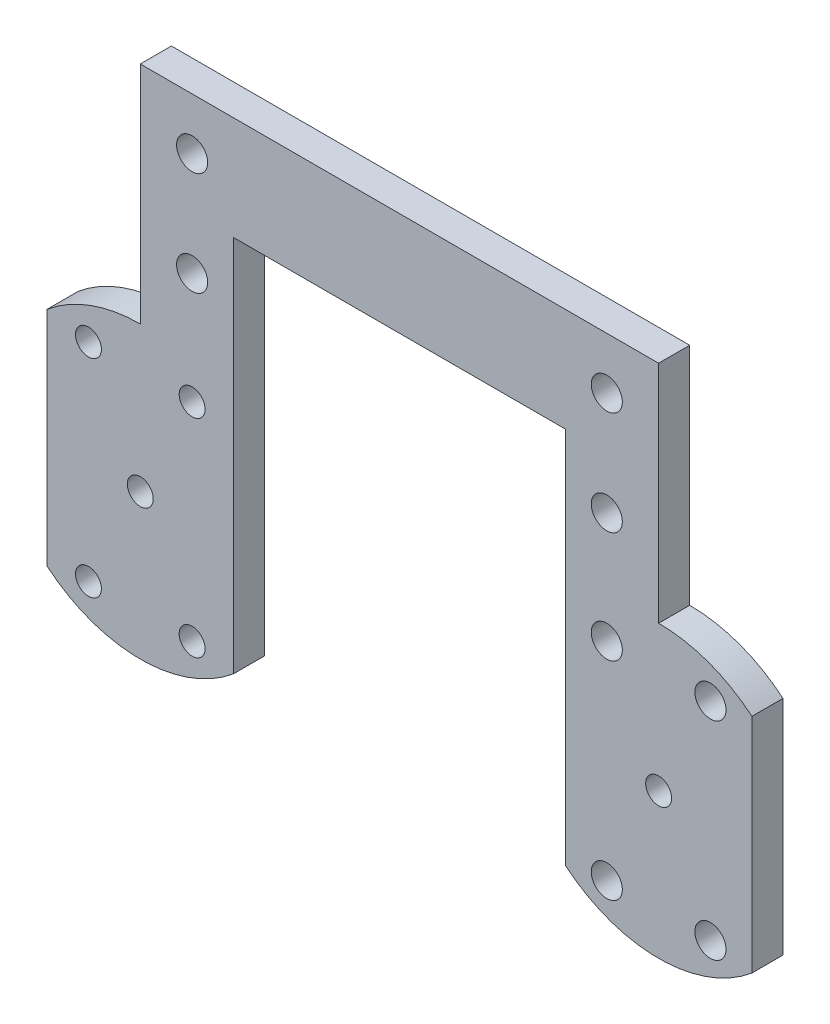
ISO-10303-21;
HEADER;
FILE_DESCRIPTION(('STEP AP214'),'2;1');
FILE_NAME('part.step','',(''),(''),'','','');
FILE_SCHEMA(('AUTOMOTIVE_DESIGN { 1 0 10303 214 1 1 1 1 }'));
ENDSEC;
DATA;
#1=APPLICATION_CONTEXT('core data for automotive mechanical design processes');
#2=APPLICATION_PROTOCOL_DEFINITION('international standard','automotive_design',2000,#1);
#3=PRODUCT_CONTEXT('',#1,'mechanical');
#4=PRODUCT('Part','Part','',(#3));
#5=PRODUCT_RELATED_PRODUCT_CATEGORY('part','',(#4));
#6=PRODUCT_DEFINITION_FORMATION('','',#4);
#7=PRODUCT_DEFINITION_CONTEXT('part definition',#1,'design');
#8=PRODUCT_DEFINITION('design','',#6,#7);
#9=PRODUCT_DEFINITION_SHAPE('','',#8);
#10=(LENGTH_UNIT() NAMED_UNIT(*) SI_UNIT(.MILLI.,.METRE.));
#11=(NAMED_UNIT(*) PLANE_ANGLE_UNIT() SI_UNIT($,.RADIAN.));
#12=(NAMED_UNIT(*) SI_UNIT($,.STERADIAN.) SOLID_ANGLE_UNIT());
#13=UNCERTAINTY_MEASURE_WITH_UNIT(LENGTH_MEASURE(1.E-05),#10,'distance_accuracy_value','');
#14=(GEOMETRIC_REPRESENTATION_CONTEXT(3) GLOBAL_UNCERTAINTY_ASSIGNED_CONTEXT((#13)) GLOBAL_UNIT_ASSIGNED_CONTEXT((#10,
#11,#12)) REPRESENTATION_CONTEXT('',''));
#15=CARTESIAN_POINT('',(0.,0.,0.));
#16=DIRECTION('',(0.,0.,1.));
#17=DIRECTION('',(1.,0.,0.));
#18=AXIS2_PLACEMENT_3D('',#15,#16,#17);
#19=CARTESIAN_POINT('',(0.,0.,3.));
#20=DIRECTION('',(0.,0.,1.));
#21=DIRECTION('',(1.,0.,0.));
#22=AXIS2_PLACEMENT_3D('',#19,#20,#21);
#23=PLANE('',#22);
#24=CARTESIAN_POINT('',(0.,0.,3.));
#25=DIRECTION('',(0.,0.,1.));
#26=DIRECTION('',(1.,0.,0.));
#27=AXIS2_PLACEMENT_3D('',#24,#25,#26);
#28=CIRCLE('',#27,14.);
#29=CARTESIAN_POINT('',(-9.,-10.7238052947636,3.));
#30=VERTEX_POINT('',#29);
#31=CARTESIAN_POINT('',(9.,-10.7238052947636,3.));
#32=VERTEX_POINT('',#31);
#33=EDGE_CURVE('E212',#30,#32,#28,.T.);
#34=ORIENTED_EDGE('',*,*,#33,.T.);
#35=DIRECTION('',(0.,1.,0.));
#36=VECTOR('',#35,1.);
#37=CARTESIAN_POINT('',(9.,10.7238052947636,3.));
#38=LINE('',#37,#36);
#39=CARTESIAN_POINT('',(9.,25.7238052947636,3.));
#40=VERTEX_POINT('',#39);
#41=EDGE_CURVE('E137',#32,#40,#38,.T.);
#42=ORIENTED_EDGE('',*,*,#41,.T.);
#43=DIRECTION('',(1.,0.,0.));
#44=VECTOR('',#43,1.);
#45=CARTESIAN_POINT('',(9.,25.7238052947636,3.));
#46=LINE('',#45,#44);
#47=CARTESIAN_POINT('',(41.,25.7238052947636,3.));
#48=VERTEX_POINT('',#47);
#49=EDGE_CURVE('E217',#40,#48,#46,.T.);
#50=ORIENTED_EDGE('',*,*,#49,.T.);
#51=DIRECTION('',(0.,-1.,0.));
#52=VECTOR('',#51,1.);
#53=CARTESIAN_POINT('',(41.,25.7238052947636,3.));
#54=LINE('',#53,#52);
#55=CARTESIAN_POINT('',(41.,-10.7238052947636,3.));
#56=VERTEX_POINT('',#55);
#57=EDGE_CURVE('E215',#48,#56,#54,.T.);
#58=ORIENTED_EDGE('',*,*,#57,.T.);
#59=CARTESIAN_POINT('',(50.,0.,3.));
#60=DIRECTION('',(0.,0.,1.));
#61=DIRECTION('',(1.,0.,0.));
#62=AXIS2_PLACEMENT_3D('',#59,#60,#61);
#63=CIRCLE('',#62,14.);
#64=CARTESIAN_POINT('',(59.,-10.7238052947636,3.));
#65=VERTEX_POINT('',#64);
#66=EDGE_CURVE('E173',#56,#65,#63,.T.);
#67=ORIENTED_EDGE('',*,*,#66,.T.);
#68=DIRECTION('',(0.,1.,0.));
#69=VECTOR('',#68,1.);
#70=CARTESIAN_POINT('',(59.,10.7238052947636,3.));
#71=LINE('',#70,#69);
#72=CARTESIAN_POINT('',(59.,10.7238052947636,3.));
#73=VERTEX_POINT('',#72);
#74=EDGE_CURVE('E192',#65,#73,#71,.T.);
#75=ORIENTED_EDGE('',*,*,#74,.T.);
#76=CARTESIAN_POINT('',(50.,0.,3.));
#77=DIRECTION('',(0.,0.,1.));
#78=DIRECTION('',(1.,0.,0.));
#79=AXIS2_PLACEMENT_3D('',#76,#77,#78);
#80=CIRCLE('',#79,14.);
#81=CARTESIAN_POINT('',(50.,14.,3.));
#82=VERTEX_POINT('',#81);
#83=EDGE_CURVE('E163',#73,#82,#80,.T.);
#84=ORIENTED_EDGE('',*,*,#83,.T.);
#85=DIRECTION('',(0.,1.,0.));
#86=VECTOR('',#85,1.);
#87=CARTESIAN_POINT('',(50.,35.7238052947636,3.));
#88=LINE('',#87,#86);
#89=CARTESIAN_POINT('',(50.,35.7238052947636,3.));
#90=VERTEX_POINT('',#89);
#91=EDGE_CURVE('E219',#82,#90,#88,.T.);
#92=ORIENTED_EDGE('',*,*,#91,.T.);
#93=DIRECTION('',(-1.,0.,0.));
#94=VECTOR('',#93,1.);
#95=CARTESIAN_POINT('',(0.,35.7238052947636,3.));
#96=LINE('',#95,#94);
#97=CARTESIAN_POINT('',(0.,35.7238052947636,3.));
#98=VERTEX_POINT('',#97);
#99=EDGE_CURVE('E360',#90,#98,#96,.T.);
#100=ORIENTED_EDGE('',*,*,#99,.T.);
#101=DIRECTION('',(0.,-1.,0.));
#102=VECTOR('',#101,1.);
#103=CARTESIAN_POINT('',(0.,14.,3.));
#104=LINE('',#103,#102);
#105=CARTESIAN_POINT('',(0.,14.,3.));
#106=VERTEX_POINT('',#105);
#107=EDGE_CURVE('E363',#98,#106,#104,.T.);
#108=ORIENTED_EDGE('',*,*,#107,.T.);
#109=CARTESIAN_POINT('',(0.,0.,3.));
#110=DIRECTION('',(0.,0.,1.));
#111=DIRECTION('',(1.,0.,0.));
#112=AXIS2_PLACEMENT_3D('',#109,#110,#111);
#113=CIRCLE('',#112,14.);
#114=CARTESIAN_POINT('',(-9.,10.7238052947636,3.));
#115=VERTEX_POINT('',#114);
#116=EDGE_CURVE('E48',#106,#115,#113,.T.);
#117=ORIENTED_EDGE('',*,*,#116,.T.);
#118=DIRECTION('',(0.,-1.,0.));
#119=VECTOR('',#118,1.);
#120=CARTESIAN_POINT('',(-9.,10.7238052947636,3.));
#121=LINE('',#120,#119);
#122=EDGE_CURVE('E210',#115,#30,#121,.T.);
#123=ORIENTED_EDGE('',*,*,#122,.T.);
#124=EDGE_LOOP('',(#34,#42,#50,#58,#67,#75,#84,#92,#100,#108,#117,#123));
#125=FACE_BOUND('',#124,.T.);
#126=CARTESIAN_POINT('',(55.,-10.,3.));
#127=DIRECTION('',(0.,0.,1.));
#128=DIRECTION('',(1.,0.,0.));
#129=AXIS2_PLACEMENT_3D('',#126,#127,#128);
#130=CIRCLE('',#129,1.5);
#131=CARTESIAN_POINT('',(56.5,-10.,3.));
#132=VERTEX_POINT('',#131);
#133=EDGE_CURVE('E239',#132,#132,#130,.T.);
#134=ORIENTED_EDGE('',*,*,#133,.F.);
#135=EDGE_LOOP('',(#134));
#136=FACE_BOUND('',#135,.T.);
#137=CARTESIAN_POINT('',(55.,10.,3.));
#138=DIRECTION('',(0.,0.,1.));
#139=DIRECTION('',(1.,0.,0.));
#140=AXIS2_PLACEMENT_3D('',#137,#138,#139);
#141=CIRCLE('',#140,1.5);
#142=CARTESIAN_POINT('',(56.5,10.,3.));
#143=VERTEX_POINT('',#142);
#144=EDGE_CURVE('E253',#143,#143,#141,.T.);
#145=ORIENTED_EDGE('',*,*,#144,.F.);
#146=EDGE_LOOP('',(#145));
#147=FACE_BOUND('',#146,.T.);
#148=CARTESIAN_POINT('',(50.,0.,3.));
#149=DIRECTION('',(0.,0.,1.));
#150=DIRECTION('',(1.,0.,0.));
#151=AXIS2_PLACEMENT_3D('',#148,#149,#150);
#152=CIRCLE('',#151,1.25);
#153=CARTESIAN_POINT('',(51.25,0.,3.));
#154=VERTEX_POINT('',#153);
#155=EDGE_CURVE('E265',#154,#154,#152,.T.);
#156=ORIENTED_EDGE('',*,*,#155,.F.);
#157=EDGE_LOOP('',(#156));
#158=FACE_BOUND('',#157,.T.);
#159=CARTESIAN_POINT('',(-5.,-10.,3.));
#160=DIRECTION('',(0.,0.,1.));
#161=DIRECTION('',(1.,0.,0.));
#162=AXIS2_PLACEMENT_3D('',#159,#160,#161);
#163=CIRCLE('',#162,1.25);
#164=CARTESIAN_POINT('',(-3.75,-10.,3.));
#165=VERTEX_POINT('',#164);
#166=EDGE_CURVE('E277',#165,#165,#163,.T.);
#167=ORIENTED_EDGE('',*,*,#166,.F.);
#168=EDGE_LOOP('',(#167));
#169=FACE_BOUND('',#168,.T.);
#170=CARTESIAN_POINT('',(-5.,10.,3.));
#171=DIRECTION('',(0.,0.,1.));
#172=DIRECTION('',(1.,0.,0.));
#173=AXIS2_PLACEMENT_3D('',#170,#171,#172);
#174=CIRCLE('',#173,1.25);
#175=CARTESIAN_POINT('',(-3.75,10.,3.));
#176=VERTEX_POINT('',#175);
#177=EDGE_CURVE('E203',#176,#176,#174,.T.);
#178=ORIENTED_EDGE('',*,*,#177,.F.);
#179=EDGE_LOOP('',(#178));
#180=FACE_BOUND('',#179,.T.);
#181=CARTESIAN_POINT('',(0.,0.,3.));
#182=DIRECTION('',(0.,0.,1.));
#183=DIRECTION('',(1.,0.,0.));
#184=AXIS2_PLACEMENT_3D('',#181,#182,#183);
#185=CIRCLE('',#184,1.25);
#186=CARTESIAN_POINT('',(1.25,0.,3.));
#187=VERTEX_POINT('',#186);
#188=EDGE_CURVE('E196',#187,#187,#185,.T.);
#189=ORIENTED_EDGE('',*,*,#188,.F.);
#190=EDGE_LOOP('',(#189));
#191=FACE_BOUND('',#190,.T.);
#192=CARTESIAN_POINT('',(5.,10.,3.));
#193=DIRECTION('',(0.,0.,1.));
#194=DIRECTION('',(1.,0.,0.));
#195=AXIS2_PLACEMENT_3D('',#192,#193,#194);
#196=CIRCLE('',#195,1.25);
#197=CARTESIAN_POINT('',(6.25,10.,3.));
#198=VERTEX_POINT('',#197);
#199=EDGE_CURVE('E283',#198,#198,#196,.T.);
#200=ORIENTED_EDGE('',*,*,#199,.F.);
#201=EDGE_LOOP('',(#200));
#202=FACE_BOUND('',#201,.T.);
#203=CARTESIAN_POINT('',(5.,-10.,3.));
#204=DIRECTION('',(0.,0.,1.));
#205=DIRECTION('',(1.,0.,0.));
#206=AXIS2_PLACEMENT_3D('',#203,#204,#205);
#207=CIRCLE('',#206,1.25);
#208=CARTESIAN_POINT('',(6.25,-10.,3.));
#209=VERTEX_POINT('',#208);
#210=EDGE_CURVE('E271',#209,#209,#207,.T.);
#211=ORIENTED_EDGE('',*,*,#210,.F.);
#212=EDGE_LOOP('',(#211));
#213=FACE_BOUND('',#212,.T.);
#214=CARTESIAN_POINT('',(45.,10.,3.));
#215=DIRECTION('',(0.,0.,1.));
#216=DIRECTION('',(1.,0.,0.));
#217=AXIS2_PLACEMENT_3D('',#214,#215,#216);
#218=CIRCLE('',#217,1.5);
#219=CARTESIAN_POINT('',(46.5,10.,3.));
#220=VERTEX_POINT('',#219);
#221=EDGE_CURVE('E259',#220,#220,#218,.T.);
#222=ORIENTED_EDGE('',*,*,#221,.F.);
#223=EDGE_LOOP('',(#222));
#224=FACE_BOUND('',#223,.T.);
#225=CARTESIAN_POINT('',(45.,-10.,3.));
#226=DIRECTION('',(0.,0.,1.));
#227=DIRECTION('',(1.,0.,0.));
#228=AXIS2_PLACEMENT_3D('',#225,#226,#227);
#229=CIRCLE('',#228,1.5);
#230=CARTESIAN_POINT('',(46.5,-10.,3.));
#231=VERTEX_POINT('',#230);
#232=EDGE_CURVE('E247',#231,#231,#229,.T.);
#233=ORIENTED_EDGE('',*,*,#232,.F.);
#234=EDGE_LOOP('',(#233));
#235=FACE_BOUND('',#234,.T.);
#236=CARTESIAN_POINT('',(5.,20.7238052947636,3.));
#237=DIRECTION('',(0.,0.,1.));
#238=DIRECTION('',(1.,0.,0.));
#239=AXIS2_PLACEMENT_3D('',#236,#237,#238);
#240=CIRCLE('',#239,1.5);
#241=CARTESIAN_POINT('',(6.5,20.7238052947636,3.));
#242=VERTEX_POINT('',#241);
#243=EDGE_CURVE('E348',#242,#242,#240,.T.);
#244=ORIENTED_EDGE('',*,*,#243,.F.);
#245=EDGE_LOOP('',(#244));
#246=FACE_BOUND('',#245,.T.);
#247=CARTESIAN_POINT('',(45.,20.7238052947636,3.));
#248=DIRECTION('',(0.,0.,1.));
#249=DIRECTION('',(1.,0.,0.));
#250=AXIS2_PLACEMENT_3D('',#247,#248,#249);
#251=CIRCLE('',#250,1.5);
#252=CARTESIAN_POINT('',(46.5,20.7238052947636,3.));
#253=VERTEX_POINT('',#252);
#254=EDGE_CURVE('E351',#253,#253,#251,.T.);
#255=ORIENTED_EDGE('',*,*,#254,.F.);
#256=EDGE_LOOP('',(#255));
#257=FACE_BOUND('',#256,.T.);
#258=CARTESIAN_POINT('',(45.,30.7238052947636,3.));
#259=DIRECTION('',(0.,0.,1.));
#260=DIRECTION('',(1.,0.,0.));
#261=AXIS2_PLACEMENT_3D('',#258,#259,#260);
#262=CIRCLE('',#261,1.5);
#263=CARTESIAN_POINT('',(46.5,30.7238052947636,3.));
#264=VERTEX_POINT('',#263);
#265=EDGE_CURVE('E354',#264,#264,#262,.T.);
#266=ORIENTED_EDGE('',*,*,#265,.F.);
#267=EDGE_LOOP('',(#266));
#268=FACE_BOUND('',#267,.T.);
#269=CARTESIAN_POINT('',(5.,30.7238052947636,3.));
#270=DIRECTION('',(0.,0.,1.));
#271=DIRECTION('',(1.,0.,0.));
#272=AXIS2_PLACEMENT_3D('',#269,#270,#271);
#273=CIRCLE('',#272,1.5);
#274=CARTESIAN_POINT('',(6.5,30.7238052947636,3.));
#275=VERTEX_POINT('',#274);
#276=EDGE_CURVE('E357',#275,#275,#273,.T.);
#277=ORIENTED_EDGE('',*,*,#276,.F.);
#278=EDGE_LOOP('',(#277));
#279=FACE_BOUND('',#278,.T.);
#280=ADVANCED_FACE('F33',(#125,#136,#147,#158,#169,#180,#191,#202,#213,#224,#235,#246,#257,#268,
#279),#23,.T.);
#281=CARTESIAN_POINT('',(0.,0.,0.));
#282=DIRECTION('',(0.,0.,1.));
#283=DIRECTION('',(1.,0.,0.));
#284=AXIS2_PLACEMENT_3D('',#281,#282,#283);
#285=PLANE('',#284);
#286=DIRECTION('',(0.,-1.,0.));
#287=VECTOR('',#286,1.);
#288=CARTESIAN_POINT('',(9.,10.7238052947636,0.));
#289=LINE('',#288,#287);
#290=CARTESIAN_POINT('',(9.,25.7238052947636,0.));
#291=VERTEX_POINT('',#290);
#292=CARTESIAN_POINT('',(9.,-10.7238052947636,0.));
#293=VERTEX_POINT('',#292);
#294=EDGE_CURVE('E120',#291,#293,#289,.T.);
#295=ORIENTED_EDGE('',*,*,#294,.T.);
#296=CARTESIAN_POINT('',(0.,0.,0.));
#297=DIRECTION('',(0.,0.,1.));
#298=DIRECTION('',(1.,0.,0.));
#299=AXIS2_PLACEMENT_3D('',#296,#297,#298);
#300=CIRCLE('',#299,14.);
#301=CARTESIAN_POINT('',(-9.,-10.7238052947636,0.));
#302=VERTEX_POINT('',#301);
#303=EDGE_CURVE('E126',#302,#293,#300,.T.);
#304=ORIENTED_EDGE('',*,*,#303,.F.);
#305=DIRECTION('',(0.,-1.,0.));
#306=VECTOR('',#305,1.);
#307=CARTESIAN_POINT('',(-9.,10.7238052947636,0.));
#308=LINE('',#307,#306);
#309=CARTESIAN_POINT('',(-9.,10.7238052947636,0.));
#310=VERTEX_POINT('',#309);
#311=EDGE_CURVE('E147',#310,#302,#308,.T.);
#312=ORIENTED_EDGE('',*,*,#311,.F.);
#313=CARTESIAN_POINT('',(0.,0.,0.));
#314=DIRECTION('',(0.,0.,1.));
#315=DIRECTION('',(1.,0.,0.));
#316=AXIS2_PLACEMENT_3D('',#313,#314,#315);
#317=CIRCLE('',#316,14.);
#318=CARTESIAN_POINT('',(0.,14.,0.));
#319=VERTEX_POINT('',#318);
#320=EDGE_CURVE('E151',#319,#310,#317,.T.);
#321=ORIENTED_EDGE('',*,*,#320,.F.);
#322=DIRECTION('',(0.,1.,0.));
#323=VECTOR('',#322,1.);
#324=CARTESIAN_POINT('',(0.,14.,0.));
#325=LINE('',#324,#323);
#326=CARTESIAN_POINT('',(0.,35.7238052947636,0.));
#327=VERTEX_POINT('',#326);
#328=EDGE_CURVE('E330',#319,#327,#325,.T.);
#329=ORIENTED_EDGE('',*,*,#328,.T.);
#330=DIRECTION('',(1.,0.,0.));
#331=VECTOR('',#330,1.);
#332=CARTESIAN_POINT('',(0.,35.7238052947636,0.));
#333=LINE('',#332,#331);
#334=CARTESIAN_POINT('',(50.,35.7238052947636,0.));
#335=VERTEX_POINT('',#334);
#336=EDGE_CURVE('E337',#327,#335,#333,.T.);
#337=ORIENTED_EDGE('',*,*,#336,.T.);
#338=DIRECTION('',(0.,-1.,0.));
#339=VECTOR('',#338,1.);
#340=CARTESIAN_POINT('',(50.,35.7238052947636,0.));
#341=LINE('',#340,#339);
#342=CARTESIAN_POINT('',(50.,14.,0.));
#343=VERTEX_POINT('',#342);
#344=EDGE_CURVE('E341',#335,#343,#341,.T.);
#345=ORIENTED_EDGE('',*,*,#344,.T.);
#346=CARTESIAN_POINT('',(50.,0.,0.));
#347=DIRECTION('',(0.,0.,1.));
#348=DIRECTION('',(1.,0.,0.));
#349=AXIS2_PLACEMENT_3D('',#346,#347,#348);
#350=CIRCLE('',#349,14.);
#351=CARTESIAN_POINT('',(59.,10.7238052947636,0.));
#352=VERTEX_POINT('',#351);
#353=EDGE_CURVE('E156',#352,#343,#350,.T.);
#354=ORIENTED_EDGE('',*,*,#353,.F.);
#355=DIRECTION('',(0.,1.,0.));
#356=VECTOR('',#355,1.);
#357=CARTESIAN_POINT('',(59.,10.7238052947636,0.));
#358=LINE('',#357,#356);
#359=CARTESIAN_POINT('',(59.,-10.7238052947636,0.));
#360=VERTEX_POINT('',#359);
#361=EDGE_CURVE('E149',#360,#352,#358,.T.);
#362=ORIENTED_EDGE('',*,*,#361,.F.);
#363=CARTESIAN_POINT('',(50.,0.,0.));
#364=DIRECTION('',(0.,0.,1.));
#365=DIRECTION('',(1.,0.,0.));
#366=AXIS2_PLACEMENT_3D('',#363,#364,#365);
#367=CIRCLE('',#366,14.);
#368=CARTESIAN_POINT('',(41.,-10.7238052947636,0.));
#369=VERTEX_POINT('',#368);
#370=EDGE_CURVE('E146',#369,#360,#367,.T.);
#371=ORIENTED_EDGE('',*,*,#370,.F.);
#372=DIRECTION('',(0.,1.,0.));
#373=VECTOR('',#372,1.);
#374=CARTESIAN_POINT('',(41.,25.7238052947636,0.));
#375=LINE('',#374,#373);
#376=CARTESIAN_POINT('',(41.,25.7238052947636,0.));
#377=VERTEX_POINT('',#376);
#378=EDGE_CURVE('E177',#369,#377,#375,.T.);
#379=ORIENTED_EDGE('',*,*,#378,.T.);
#380=DIRECTION('',(-1.,0.,0.));
#381=VECTOR('',#380,1.);
#382=CARTESIAN_POINT('',(9.,25.7238052947636,0.));
#383=LINE('',#382,#381);
#384=EDGE_CURVE('E128',#377,#291,#383,.T.);
#385=ORIENTED_EDGE('',*,*,#384,.T.);
#386=EDGE_LOOP('',(#295,#304,#312,#321,#329,#337,#345,#354,#362,#371,#379,#385));
#387=FACE_BOUND('',#386,.T.);
#388=CARTESIAN_POINT('',(0.,0.,0.));
#389=DIRECTION('',(0.,0.,1.));
#390=DIRECTION('',(1.,0.,0.));
#391=AXIS2_PLACEMENT_3D('',#388,#389,#390);
#392=CIRCLE('',#391,1.25);
#393=CARTESIAN_POINT('',(1.25,0.,0.));
#394=VERTEX_POINT('',#393);
#395=EDGE_CURVE('E198',#394,#394,#392,.T.);
#396=ORIENTED_EDGE('',*,*,#395,.T.);
#397=EDGE_LOOP('',(#396));
#398=FACE_BOUND('',#397,.T.);
#399=CARTESIAN_POINT('',(-5.,10.,0.));
#400=DIRECTION('',(0.,0.,1.));
#401=DIRECTION('',(1.,0.,0.));
#402=AXIS2_PLACEMENT_3D('',#399,#400,#401);
#403=CIRCLE('',#402,1.25);
#404=CARTESIAN_POINT('',(-3.75,10.,0.));
#405=VERTEX_POINT('',#404);
#406=EDGE_CURVE('E206',#405,#405,#403,.T.);
#407=ORIENTED_EDGE('',*,*,#406,.T.);
#408=EDGE_LOOP('',(#407));
#409=FACE_BOUND('',#408,.T.);
#410=CARTESIAN_POINT('',(5.,10.,0.));
#411=DIRECTION('',(0.,0.,1.));
#412=DIRECTION('',(1.,0.,0.));
#413=AXIS2_PLACEMENT_3D('',#410,#411,#412);
#414=CIRCLE('',#413,1.25);
#415=CARTESIAN_POINT('',(6.25,10.,0.));
#416=VERTEX_POINT('',#415);
#417=EDGE_CURVE('E280',#416,#416,#414,.T.);
#418=ORIENTED_EDGE('',*,*,#417,.T.);
#419=EDGE_LOOP('',(#418));
#420=FACE_BOUND('',#419,.T.);
#421=CARTESIAN_POINT('',(-5.,-10.,0.));
#422=DIRECTION('',(0.,0.,1.));
#423=DIRECTION('',(1.,0.,0.));
#424=AXIS2_PLACEMENT_3D('',#421,#422,#423);
#425=CIRCLE('',#424,1.25);
#426=CARTESIAN_POINT('',(-3.75,-10.,0.));
#427=VERTEX_POINT('',#426);
#428=EDGE_CURVE('E274',#427,#427,#425,.T.);
#429=ORIENTED_EDGE('',*,*,#428,.T.);
#430=EDGE_LOOP('',(#429));
#431=FACE_BOUND('',#430,.T.);
#432=CARTESIAN_POINT('',(5.,-10.,0.));
#433=DIRECTION('',(0.,0.,1.));
#434=DIRECTION('',(1.,0.,0.));
#435=AXIS2_PLACEMENT_3D('',#432,#433,#434);
#436=CIRCLE('',#435,1.25);
#437=CARTESIAN_POINT('',(6.25,-10.,0.));
#438=VERTEX_POINT('',#437);
#439=EDGE_CURVE('E268',#438,#438,#436,.T.);
#440=ORIENTED_EDGE('',*,*,#439,.T.);
#441=EDGE_LOOP('',(#440));
#442=FACE_BOUND('',#441,.T.);
#443=CARTESIAN_POINT('',(50.,0.,0.));
#444=DIRECTION('',(0.,0.,1.));
#445=DIRECTION('',(1.,0.,0.));
#446=AXIS2_PLACEMENT_3D('',#443,#444,#445);
#447=CIRCLE('',#446,1.25);
#448=CARTESIAN_POINT('',(51.25,0.,0.));
#449=VERTEX_POINT('',#448);
#450=EDGE_CURVE('E262',#449,#449,#447,.T.);
#451=ORIENTED_EDGE('',*,*,#450,.T.);
#452=EDGE_LOOP('',(#451));
#453=FACE_BOUND('',#452,.T.);
#454=CARTESIAN_POINT('',(45.,10.,0.));
#455=DIRECTION('',(0.,0.,1.));
#456=DIRECTION('',(1.,0.,0.));
#457=AXIS2_PLACEMENT_3D('',#454,#455,#456);
#458=CIRCLE('',#457,1.5);
#459=CARTESIAN_POINT('',(46.5,10.,0.));
#460=VERTEX_POINT('',#459);
#461=EDGE_CURVE('E256',#460,#460,#458,.T.);
#462=ORIENTED_EDGE('',*,*,#461,.T.);
#463=EDGE_LOOP('',(#462));
#464=FACE_BOUND('',#463,.T.);
#465=CARTESIAN_POINT('',(55.,10.,0.));
#466=DIRECTION('',(0.,0.,1.));
#467=DIRECTION('',(1.,0.,0.));
#468=AXIS2_PLACEMENT_3D('',#465,#466,#467);
#469=CIRCLE('',#468,1.5);
#470=CARTESIAN_POINT('',(56.5,10.,0.));
#471=VERTEX_POINT('',#470);
#472=EDGE_CURVE('E250',#471,#471,#469,.T.);
#473=ORIENTED_EDGE('',*,*,#472,.T.);
#474=EDGE_LOOP('',(#473));
#475=FACE_BOUND('',#474,.T.);
#476=CARTESIAN_POINT('',(45.,-10.,0.));
#477=DIRECTION('',(0.,0.,1.));
#478=DIRECTION('',(1.,0.,0.));
#479=AXIS2_PLACEMENT_3D('',#476,#477,#478);
#480=CIRCLE('',#479,1.5);
#481=CARTESIAN_POINT('',(46.5,-10.,0.));
#482=VERTEX_POINT('',#481);
#483=EDGE_CURVE('E242',#482,#482,#480,.T.);
#484=ORIENTED_EDGE('',*,*,#483,.T.);
#485=EDGE_LOOP('',(#484));
#486=FACE_BOUND('',#485,.T.);
#487=CARTESIAN_POINT('',(55.,-10.,0.));
#488=DIRECTION('',(0.,0.,1.));
#489=DIRECTION('',(1.,0.,0.));
#490=AXIS2_PLACEMENT_3D('',#487,#488,#489);
#491=CIRCLE('',#490,1.5);
#492=CARTESIAN_POINT('',(56.5,-10.,0.));
#493=VERTEX_POINT('',#492);
#494=EDGE_CURVE('E243',#493,#493,#491,.T.);
#495=ORIENTED_EDGE('',*,*,#494,.T.);
#496=EDGE_LOOP('',(#495));
#497=FACE_BOUND('',#496,.T.);
#498=CARTESIAN_POINT('',(45.,30.7238052947636,0.));
#499=DIRECTION('',(0.,0.,1.));
#500=DIRECTION('',(1.,0.,0.));
#501=AXIS2_PLACEMENT_3D('',#498,#499,#500);
#502=CIRCLE('',#501,1.5);
#503=CARTESIAN_POINT('',(46.5,30.7238052947636,0.));
#504=VERTEX_POINT('',#503);
#505=EDGE_CURVE('E238',#504,#504,#502,.F.);
#506=ORIENTED_EDGE('',*,*,#505,.F.);
#507=EDGE_LOOP('',(#506));
#508=FACE_BOUND('',#507,.T.);
#509=CARTESIAN_POINT('',(5.,20.7238052947636,0.));
#510=DIRECTION('',(0.,0.,1.));
#511=DIRECTION('',(1.,0.,0.));
#512=AXIS2_PLACEMENT_3D('',#509,#510,#511);
#513=CIRCLE('',#512,1.5);
#514=CARTESIAN_POINT('',(6.5,20.7238052947636,0.));
#515=VERTEX_POINT('',#514);
#516=EDGE_CURVE('E234',#515,#515,#513,.F.);
#517=ORIENTED_EDGE('',*,*,#516,.F.);
#518=EDGE_LOOP('',(#517));
#519=FACE_BOUND('',#518,.T.);
#520=CARTESIAN_POINT('',(45.,20.7238052947636,0.));
#521=DIRECTION('',(0.,0.,1.));
#522=DIRECTION('',(1.,0.,0.));
#523=AXIS2_PLACEMENT_3D('',#520,#521,#522);
#524=CIRCLE('',#523,1.5);
#525=CARTESIAN_POINT('',(46.5,20.7238052947636,0.));
#526=VERTEX_POINT('',#525);
#527=EDGE_CURVE('E237',#526,#526,#524,.F.);
#528=ORIENTED_EDGE('',*,*,#527,.F.);
#529=EDGE_LOOP('',(#528));
#530=FACE_BOUND('',#529,.T.);
#531=CARTESIAN_POINT('',(5.,30.7238052947636,0.));
#532=DIRECTION('',(0.,0.,1.));
#533=DIRECTION('',(1.,0.,0.));
#534=AXIS2_PLACEMENT_3D('',#531,#532,#533);
#535=CIRCLE('',#534,1.5);
#536=CARTESIAN_POINT('',(6.5,30.7238052947636,0.));
#537=VERTEX_POINT('',#536);
#538=EDGE_CURVE('E246',#537,#537,#535,.F.);
#539=ORIENTED_EDGE('',*,*,#538,.F.);
#540=EDGE_LOOP('',(#539));
#541=FACE_BOUND('',#540,.T.);
#542=ADVANCED_FACE('F122',(#387,#398,#409,#420,#431,#442,#453,#464,#475,#486,#497,#508,#519,
#530,#541),#285,.F.);
#543=CARTESIAN_POINT('',(0.,0.,3.));
#544=DIRECTION('',(0.,0.,-1.));
#545=DIRECTION('',(-1.,0.,0.));
#546=AXIS2_PLACEMENT_3D('',#543,#544,#545);
#547=CYLINDRICAL_SURFACE('',#546,14.);
#548=ORIENTED_EDGE('',*,*,#116,.F.);
#549=DIRECTION('',(0.,0.,1.));
#550=VECTOR('',#549,1.);
#551=CARTESIAN_POINT('',(0.,14.,-55.9016994374947));
#552=LINE('',#551,#550);
#553=EDGE_CURVE('E52',#319,#106,#552,.T.);
#554=ORIENTED_EDGE('',*,*,#553,.F.);
#555=ORIENTED_EDGE('',*,*,#320,.T.);
#556=DIRECTION('',(0.,0.,-1.));
#557=VECTOR('',#556,1.);
#558=CARTESIAN_POINT('',(-9.,10.7238052947636,3.));
#559=LINE('',#558,#557);
#560=EDGE_CURVE('E11',#115,#310,#559,.T.);
#561=ORIENTED_EDGE('',*,*,#560,.F.);
#562=EDGE_LOOP('',(#548,#554,#555,#561));
#563=FACE_BOUND('',#562,.T.);
#564=ADVANCED_FACE('F35',(#563),#547,.T.);
#565=CARTESIAN_POINT('',(-9.,10.7238052947636,3.));
#566=DIRECTION('',(1.,0.,0.));
#567=DIRECTION('',(0.,0.,-1.));
#568=AXIS2_PLACEMENT_3D('',#565,#566,#567);
#569=PLANE('',#568);
#570=ORIENTED_EDGE('',*,*,#311,.T.);
#571=DIRECTION('',(0.,0.,-1.));
#572=VECTOR('',#571,1.);
#573=CARTESIAN_POINT('',(-9.,-10.7238052947636,3.));
#574=LINE('',#573,#572);
#575=EDGE_CURVE('E41',#30,#302,#574,.T.);
#576=ORIENTED_EDGE('',*,*,#575,.F.);
#577=ORIENTED_EDGE('',*,*,#122,.F.);
#578=ORIENTED_EDGE('',*,*,#560,.T.);
#579=EDGE_LOOP('',(#570,#576,#577,#578));
#580=FACE_BOUND('',#579,.T.);
#581=ADVANCED_FACE('F322',(#580),#569,.F.);
#582=CARTESIAN_POINT('',(0.,0.,3.));
#583=DIRECTION('',(0.,0.,-1.));
#584=DIRECTION('',(-1.,0.,0.));
#585=AXIS2_PLACEMENT_3D('',#582,#583,#584);
#586=CYLINDRICAL_SURFACE('',#585,14.);
#587=ORIENTED_EDGE('',*,*,#303,.T.);
#588=DIRECTION('',(0.,0.,-1.));
#589=VECTOR('',#588,1.);
#590=CARTESIAN_POINT('',(9.,-10.7238052947636,3.));
#591=LINE('',#590,#589);
#592=EDGE_CURVE('E134',#32,#293,#591,.T.);
#593=ORIENTED_EDGE('',*,*,#592,.F.);
#594=ORIENTED_EDGE('',*,*,#33,.F.);
#595=ORIENTED_EDGE('',*,*,#575,.T.);
#596=EDGE_LOOP('',(#587,#593,#594,#595));
#597=FACE_BOUND('',#596,.T.);
#598=ADVANCED_FACE('F144',(#597),#586,.T.);
#599=CARTESIAN_POINT('',(50.,0.,3.));
#600=DIRECTION('',(0.,0.,-1.));
#601=DIRECTION('',(-1.,0.,0.));
#602=AXIS2_PLACEMENT_3D('',#599,#600,#601);
#603=CYLINDRICAL_SURFACE('',#602,14.);
#604=ORIENTED_EDGE('',*,*,#370,.T.);
#605=DIRECTION('',(0.,0.,-1.));
#606=VECTOR('',#605,1.);
#607=CARTESIAN_POINT('',(59.,-10.7238052947636,3.));
#608=LINE('',#607,#606);
#609=EDGE_CURVE('E162',#65,#360,#608,.T.);
#610=ORIENTED_EDGE('',*,*,#609,.F.);
#611=ORIENTED_EDGE('',*,*,#66,.F.);
#612=DIRECTION('',(0.,0.,-1.));
#613=VECTOR('',#612,1.);
#614=CARTESIAN_POINT('',(41.,-10.7238052947636,3.));
#615=LINE('',#614,#613);
#616=EDGE_CURVE('E141',#56,#369,#615,.T.);
#617=ORIENTED_EDGE('',*,*,#616,.T.);
#618=EDGE_LOOP('',(#604,#610,#611,#617));
#619=FACE_BOUND('',#618,.T.);
#620=ADVANCED_FACE('F171',(#619),#603,.T.);
#621=CARTESIAN_POINT('',(59.,10.7238052947636,3.));
#622=DIRECTION('',(-1.,0.,0.));
#623=DIRECTION('',(0.,0.,1.));
#624=AXIS2_PLACEMENT_3D('',#621,#622,#623);
#625=PLANE('',#624);
#626=ORIENTED_EDGE('',*,*,#361,.T.);
#627=DIRECTION('',(0.,0.,-1.));
#628=VECTOR('',#627,1.);
#629=CARTESIAN_POINT('',(59.,10.7238052947636,3.));
#630=LINE('',#629,#628);
#631=EDGE_CURVE('E159',#73,#352,#630,.T.);
#632=ORIENTED_EDGE('',*,*,#631,.F.);
#633=ORIENTED_EDGE('',*,*,#74,.F.);
#634=ORIENTED_EDGE('',*,*,#609,.T.);
#635=EDGE_LOOP('',(#626,#632,#633,#634));
#636=FACE_BOUND('',#635,.T.);
#637=ADVANCED_FACE('F181',(#636),#625,.F.);
#638=CARTESIAN_POINT('',(50.,0.,3.));
#639=DIRECTION('',(0.,0.,-1.));
#640=DIRECTION('',(-1.,0.,0.));
#641=AXIS2_PLACEMENT_3D('',#638,#639,#640);
#642=CYLINDRICAL_SURFACE('',#641,14.);
#643=ORIENTED_EDGE('',*,*,#353,.T.);
#644=DIRECTION('',(0.,0.,1.));
#645=VECTOR('',#644,1.);
#646=CARTESIAN_POINT('',(50.,14.,-55.9016994374947));
#647=LINE('',#646,#645);
#648=EDGE_CURVE('E189',#343,#82,#647,.T.);
#649=ORIENTED_EDGE('',*,*,#648,.T.);
#650=ORIENTED_EDGE('',*,*,#83,.F.);
#651=ORIENTED_EDGE('',*,*,#631,.T.);
#652=EDGE_LOOP('',(#643,#649,#650,#651));
#653=FACE_BOUND('',#652,.T.);
#654=ADVANCED_FACE('F185',(#653),#642,.T.);
#655=CARTESIAN_POINT('',(0.,0.,3.));
#656=DIRECTION('',(0.,0.,-1.));
#657=DIRECTION('',(-1.,0.,0.));
#658=AXIS2_PLACEMENT_3D('',#655,#656,#657);
#659=CYLINDRICAL_SURFACE('',#658,1.25);
#660=ORIENTED_EDGE('',*,*,#188,.T.);
#661=EDGE_LOOP('',(#660));
#662=FACE_BOUND('',#661,.T.);
#663=ORIENTED_EDGE('',*,*,#395,.F.);
#664=EDGE_LOOP('',(#663));
#665=FACE_BOUND('',#664,.T.);
#666=ADVANCED_FACE('F298',(#662,#665),#659,.F.);
#667=CARTESIAN_POINT('',(-5.,10.,3.));
#668=DIRECTION('',(0.,0.,-1.));
#669=DIRECTION('',(-1.,0.,0.));
#670=AXIS2_PLACEMENT_3D('',#667,#668,#669);
#671=CYLINDRICAL_SURFACE('',#670,1.25);
#672=ORIENTED_EDGE('',*,*,#177,.T.);
#673=EDGE_LOOP('',(#672));
#674=FACE_BOUND('',#673,.T.);
#675=ORIENTED_EDGE('',*,*,#406,.F.);
#676=EDGE_LOOP('',(#675));
#677=FACE_BOUND('',#676,.T.);
#678=ADVANCED_FACE('F295',(#674,#677),#671,.F.);
#679=CARTESIAN_POINT('',(5.,10.,3.));
#680=DIRECTION('',(0.,0.,-1.));
#681=DIRECTION('',(-1.,0.,0.));
#682=AXIS2_PLACEMENT_3D('',#679,#680,#681);
#683=CYLINDRICAL_SURFACE('',#682,1.25);
#684=ORIENTED_EDGE('',*,*,#199,.T.);
#685=EDGE_LOOP('',(#684));
#686=FACE_BOUND('',#685,.T.);
#687=ORIENTED_EDGE('',*,*,#417,.F.);
#688=EDGE_LOOP('',(#687));
#689=FACE_BOUND('',#688,.T.);
#690=ADVANCED_FACE('F297',(#686,#689),#683,.F.);
#691=CARTESIAN_POINT('',(-5.,-10.,3.));
#692=DIRECTION('',(0.,0.,-1.));
#693=DIRECTION('',(-1.,0.,0.));
#694=AXIS2_PLACEMENT_3D('',#691,#692,#693);
#695=CYLINDRICAL_SURFACE('',#694,1.25);
#696=ORIENTED_EDGE('',*,*,#166,.T.);
#697=EDGE_LOOP('',(#696));
#698=FACE_BOUND('',#697,.T.);
#699=ORIENTED_EDGE('',*,*,#428,.F.);
#700=EDGE_LOOP('',(#699));
#701=FACE_BOUND('',#700,.T.);
#702=ADVANCED_FACE('F304',(#698,#701),#695,.F.);
#703=CARTESIAN_POINT('',(5.,-10.,3.));
#704=DIRECTION('',(0.,0.,-1.));
#705=DIRECTION('',(-1.,0.,0.));
#706=AXIS2_PLACEMENT_3D('',#703,#704,#705);
#707=CYLINDRICAL_SURFACE('',#706,1.25);
#708=ORIENTED_EDGE('',*,*,#210,.T.);
#709=EDGE_LOOP('',(#708));
#710=FACE_BOUND('',#709,.T.);
#711=ORIENTED_EDGE('',*,*,#439,.F.);
#712=EDGE_LOOP('',(#711));
#713=FACE_BOUND('',#712,.T.);
#714=ADVANCED_FACE('F411',(#710,#713),#707,.F.);
#715=CARTESIAN_POINT('',(50.,0.,3.));
#716=DIRECTION('',(0.,0.,-1.));
#717=DIRECTION('',(-1.,0.,0.));
#718=AXIS2_PLACEMENT_3D('',#715,#716,#717);
#719=CYLINDRICAL_SURFACE('',#718,1.25);
#720=ORIENTED_EDGE('',*,*,#155,.T.);
#721=EDGE_LOOP('',(#720));
#722=FACE_BOUND('',#721,.T.);
#723=ORIENTED_EDGE('',*,*,#450,.F.);
#724=EDGE_LOOP('',(#723));
#725=FACE_BOUND('',#724,.T.);
#726=ADVANCED_FACE('F407',(#722,#725),#719,.F.);
#727=CARTESIAN_POINT('',(45.,10.,3.));
#728=DIRECTION('',(0.,0.,-1.));
#729=DIRECTION('',(-1.,0.,0.));
#730=AXIS2_PLACEMENT_3D('',#727,#728,#729);
#731=CYLINDRICAL_SURFACE('',#730,1.5);
#732=ORIENTED_EDGE('',*,*,#221,.T.);
#733=EDGE_LOOP('',(#732));
#734=FACE_BOUND('',#733,.T.);
#735=ORIENTED_EDGE('',*,*,#461,.F.);
#736=EDGE_LOOP('',(#735));
#737=FACE_BOUND('',#736,.T.);
#738=ADVANCED_FACE('F403',(#734,#737),#731,.F.);
#739=CARTESIAN_POINT('',(55.,10.,3.));
#740=DIRECTION('',(0.,0.,-1.));
#741=DIRECTION('',(-1.,0.,0.));
#742=AXIS2_PLACEMENT_3D('',#739,#740,#741);
#743=CYLINDRICAL_SURFACE('',#742,1.5);
#744=ORIENTED_EDGE('',*,*,#144,.T.);
#745=EDGE_LOOP('',(#744));
#746=FACE_BOUND('',#745,.T.);
#747=ORIENTED_EDGE('',*,*,#472,.F.);
#748=EDGE_LOOP('',(#747));
#749=FACE_BOUND('',#748,.T.);
#750=ADVANCED_FACE('F399',(#746,#749),#743,.F.);
#751=CARTESIAN_POINT('',(45.,-10.,3.));
#752=DIRECTION('',(0.,0.,-1.));
#753=DIRECTION('',(-1.,0.,0.));
#754=AXIS2_PLACEMENT_3D('',#751,#752,#753);
#755=CYLINDRICAL_SURFACE('',#754,1.5);
#756=ORIENTED_EDGE('',*,*,#232,.T.);
#757=EDGE_LOOP('',(#756));
#758=FACE_BOUND('',#757,.T.);
#759=ORIENTED_EDGE('',*,*,#483,.F.);
#760=EDGE_LOOP('',(#759));
#761=FACE_BOUND('',#760,.T.);
#762=ADVANCED_FACE('F395',(#758,#761),#755,.F.);
#763=CARTESIAN_POINT('',(55.,-10.,3.));
#764=DIRECTION('',(0.,0.,-1.));
#765=DIRECTION('',(-1.,0.,0.));
#766=AXIS2_PLACEMENT_3D('',#763,#764,#765);
#767=CYLINDRICAL_SURFACE('',#766,1.5);
#768=ORIENTED_EDGE('',*,*,#133,.T.);
#769=EDGE_LOOP('',(#768));
#770=FACE_BOUND('',#769,.T.);
#771=ORIENTED_EDGE('',*,*,#494,.F.);
#772=EDGE_LOOP('',(#771));
#773=FACE_BOUND('',#772,.T.);
#774=ADVANCED_FACE('F391',(#770,#773),#767,.F.);
#775=CARTESIAN_POINT('',(0.,14.,-55.9016994374947));
#776=DIRECTION('',(-1.,0.,0.));
#777=DIRECTION('',(0.,0.,1.));
#778=AXIS2_PLACEMENT_3D('',#775,#776,#777);
#779=PLANE('',#778);
#780=ORIENTED_EDGE('',*,*,#328,.F.);
#781=ORIENTED_EDGE('',*,*,#553,.T.);
#782=ORIENTED_EDGE('',*,*,#107,.F.);
#783=DIRECTION('',(0.,0.,1.));
#784=VECTOR('',#783,1.);
#785=CARTESIAN_POINT('',(0.,35.7238052947636,-55.9016994374947));
#786=LINE('',#785,#784);
#787=EDGE_CURVE('E221',#327,#98,#786,.T.);
#788=ORIENTED_EDGE('',*,*,#787,.F.);
#789=EDGE_LOOP('',(#780,#781,#782,#788));
#790=FACE_BOUND('',#789,.T.);
#791=ADVANCED_FACE('F334',(#790),#779,.T.);
#792=CARTESIAN_POINT('',(9.,10.7238052947636,-55.9016994374947));
#793=DIRECTION('',(1.,0.,0.));
#794=DIRECTION('',(0.,0.,-1.));
#795=AXIS2_PLACEMENT_3D('',#792,#793,#794);
#796=PLANE('',#795);
#797=ORIENTED_EDGE('',*,*,#294,.F.);
#798=DIRECTION('',(0.,0.,1.));
#799=VECTOR('',#798,1.);
#800=CARTESIAN_POINT('',(9.,25.7238052947636,-55.9016994374947));
#801=LINE('',#800,#799);
#802=EDGE_CURVE('E230',#291,#40,#801,.T.);
#803=ORIENTED_EDGE('',*,*,#802,.T.);
#804=ORIENTED_EDGE('',*,*,#41,.F.);
#805=ORIENTED_EDGE('',*,*,#592,.T.);
#806=EDGE_LOOP('',(#797,#803,#804,#805));
#807=FACE_BOUND('',#806,.T.);
#808=ADVANCED_FACE('F135',(#807),#796,.T.);
#809=CARTESIAN_POINT('',(9.,25.7238052947636,-55.9016994374947));
#810=DIRECTION('',(0.,-1.,0.));
#811=DIRECTION('',(0.,0.,-1.));
#812=AXIS2_PLACEMENT_3D('',#809,#810,#811);
#813=PLANE('',#812);
#814=ORIENTED_EDGE('',*,*,#384,.F.);
#815=DIRECTION('',(0.,0.,1.));
#816=VECTOR('',#815,1.);
#817=CARTESIAN_POINT('',(41.,25.7238052947636,-55.9016994374947));
#818=LINE('',#817,#816);
#819=EDGE_CURVE('E228',#377,#48,#818,.T.);
#820=ORIENTED_EDGE('',*,*,#819,.T.);
#821=ORIENTED_EDGE('',*,*,#49,.F.);
#822=ORIENTED_EDGE('',*,*,#802,.F.);
#823=EDGE_LOOP('',(#814,#820,#821,#822));
#824=FACE_BOUND('',#823,.T.);
#825=ADVANCED_FACE('F380',(#824),#813,.T.);
#826=CARTESIAN_POINT('',(41.,25.7238052947636,-55.9016994374947));
#827=DIRECTION('',(-1.,0.,0.));
#828=DIRECTION('',(0.,0.,1.));
#829=AXIS2_PLACEMENT_3D('',#826,#827,#828);
#830=PLANE('',#829);
#831=ORIENTED_EDGE('',*,*,#378,.F.);
#832=ORIENTED_EDGE('',*,*,#616,.F.);
#833=ORIENTED_EDGE('',*,*,#57,.F.);
#834=ORIENTED_EDGE('',*,*,#819,.F.);
#835=EDGE_LOOP('',(#831,#832,#833,#834));
#836=FACE_BOUND('',#835,.T.);
#837=ADVANCED_FACE('F372',(#836),#830,.T.);
#838=CARTESIAN_POINT('',(50.,35.7238052947636,-55.9016994374947));
#839=DIRECTION('',(1.,0.,0.));
#840=DIRECTION('',(0.,1.,0.));
#841=AXIS2_PLACEMENT_3D('',#838,#839,#840);
#842=PLANE('',#841);
#843=ORIENTED_EDGE('',*,*,#344,.F.);
#844=DIRECTION('',(0.,0.,1.));
#845=VECTOR('',#844,1.);
#846=CARTESIAN_POINT('',(50.,35.7238052947636,-55.9016994374947));
#847=LINE('',#846,#845);
#848=EDGE_CURVE('E131',#335,#90,#847,.T.);
#849=ORIENTED_EDGE('',*,*,#848,.T.);
#850=ORIENTED_EDGE('',*,*,#91,.F.);
#851=ORIENTED_EDGE('',*,*,#648,.F.);
#852=EDGE_LOOP('',(#843,#849,#850,#851));
#853=FACE_BOUND('',#852,.T.);
#854=ADVANCED_FACE('F370',(#853),#842,.T.);
#855=CARTESIAN_POINT('',(0.,35.7238052947636,-55.9016994374947));
#856=DIRECTION('',(0.,1.,0.));
#857=DIRECTION('',(0.,0.,1.));
#858=AXIS2_PLACEMENT_3D('',#855,#856,#857);
#859=PLANE('',#858);
#860=ORIENTED_EDGE('',*,*,#336,.F.);
#861=ORIENTED_EDGE('',*,*,#787,.T.);
#862=ORIENTED_EDGE('',*,*,#99,.F.);
#863=ORIENTED_EDGE('',*,*,#848,.F.);
#864=EDGE_LOOP('',(#860,#861,#862,#863));
#865=FACE_BOUND('',#864,.T.);
#866=ADVANCED_FACE('F367',(#865),#859,.T.);
#867=CARTESIAN_POINT('',(5.,30.7238052947636,-55.9016994374947));
#868=DIRECTION('',(0.,0.,1.));
#869=DIRECTION('',(1.,0.,0.));
#870=AXIS2_PLACEMENT_3D('',#867,#868,#869);
#871=CYLINDRICAL_SURFACE('',#870,1.5);
#872=ORIENTED_EDGE('',*,*,#538,.T.);
#873=EDGE_LOOP('',(#872));
#874=FACE_BOUND('',#873,.T.);
#875=ORIENTED_EDGE('',*,*,#276,.T.);
#876=EDGE_LOOP('',(#875));
#877=FACE_BOUND('',#876,.T.);
#878=ADVANCED_FACE('F378',(#874,#877),#871,.F.);
#879=CARTESIAN_POINT('',(45.,30.7238052947636,-55.9016994374947));
#880=DIRECTION('',(0.,0.,1.));
#881=DIRECTION('',(1.,0.,0.));
#882=AXIS2_PLACEMENT_3D('',#879,#880,#881);
#883=CYLINDRICAL_SURFACE('',#882,1.5);
#884=ORIENTED_EDGE('',*,*,#505,.T.);
#885=EDGE_LOOP('',(#884));
#886=FACE_BOUND('',#885,.T.);
#887=ORIENTED_EDGE('',*,*,#265,.T.);
#888=EDGE_LOOP('',(#887));
#889=FACE_BOUND('',#888,.T.);
#890=ADVANCED_FACE('F453',(#886,#889),#883,.F.);
#891=CARTESIAN_POINT('',(45.,20.7238052947636,-55.9016994374947));
#892=DIRECTION('',(0.,0.,1.));
#893=DIRECTION('',(1.,0.,0.));
#894=AXIS2_PLACEMENT_3D('',#891,#892,#893);
#895=CYLINDRICAL_SURFACE('',#894,1.5);
#896=ORIENTED_EDGE('',*,*,#527,.T.);
#897=EDGE_LOOP('',(#896));
#898=FACE_BOUND('',#897,.T.);
#899=ORIENTED_EDGE('',*,*,#254,.T.);
#900=EDGE_LOOP('',(#899));
#901=FACE_BOUND('',#900,.T.);
#902=ADVANCED_FACE('F449',(#898,#901),#895,.F.);
#903=CARTESIAN_POINT('',(5.,20.7238052947636,-55.9016994374947));
#904=DIRECTION('',(0.,0.,1.));
#905=DIRECTION('',(1.,0.,0.));
#906=AXIS2_PLACEMENT_3D('',#903,#904,#905);
#907=CYLINDRICAL_SURFACE('',#906,1.5);
#908=ORIENTED_EDGE('',*,*,#516,.T.);
#909=EDGE_LOOP('',(#908));
#910=FACE_BOUND('',#909,.T.);
#911=ORIENTED_EDGE('',*,*,#243,.T.);
#912=EDGE_LOOP('',(#911));
#913=FACE_BOUND('',#912,.T.);
#914=ADVANCED_FACE('F452',(#910,#913),#907,.F.);
#915=CLOSED_SHELL('',(#280,#542,#564,#581,#598,#620,#637,#654,#666,#678,#690,#702,#714,#726,
#738,#750,#762,#774,#791,#808,#825,#837,#854,#866,#878,#890,#902,#914));
#916=MANIFOLD_SOLID_BREP('B2',#915);
#917=ADVANCED_BREP_SHAPE_REPRESENTATION('',(#18,#916),#14);
#918=SHAPE_DEFINITION_REPRESENTATION(#9,#917);
ENDSEC;
END-ISO-10303-21;
